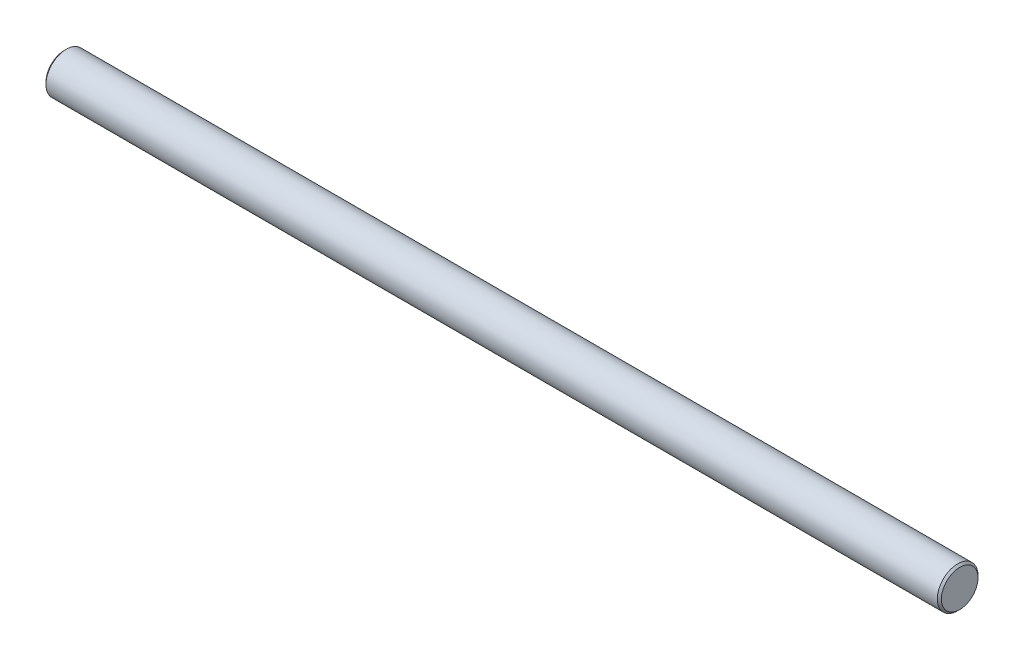
ISO-10303-21;
HEADER;
FILE_DESCRIPTION(('STEP AP214'),'2;1');
FILE_NAME('part.step','',(''),(''),'','','');
FILE_SCHEMA(('AUTOMOTIVE_DESIGN { 1 0 10303 214 1 1 1 1 }'));
ENDSEC;
DATA;
#1=APPLICATION_CONTEXT('core data for automotive mechanical design processes');
#2=APPLICATION_PROTOCOL_DEFINITION('international standard','automotive_design',2000,#1);
#3=PRODUCT_CONTEXT('',#1,'mechanical');
#4=PRODUCT('Part','Part','',(#3));
#5=PRODUCT_RELATED_PRODUCT_CATEGORY('part','',(#4));
#6=PRODUCT_DEFINITION_FORMATION('','',#4);
#7=PRODUCT_DEFINITION_CONTEXT('part definition',#1,'design');
#8=PRODUCT_DEFINITION('design','',#6,#7);
#9=PRODUCT_DEFINITION_SHAPE('','',#8);
#10=(LENGTH_UNIT() NAMED_UNIT(*) SI_UNIT(.MILLI.,.METRE.));
#11=(NAMED_UNIT(*) PLANE_ANGLE_UNIT() SI_UNIT($,.RADIAN.));
#12=(NAMED_UNIT(*) SI_UNIT($,.STERADIAN.) SOLID_ANGLE_UNIT());
#13=UNCERTAINTY_MEASURE_WITH_UNIT(LENGTH_MEASURE(1.E-05),#10,'distance_accuracy_value','');
#14=(GEOMETRIC_REPRESENTATION_CONTEXT(3) GLOBAL_UNCERTAINTY_ASSIGNED_CONTEXT((#13)) GLOBAL_UNIT_ASSIGNED_CONTEXT((#10,
#11,#12)) REPRESENTATION_CONTEXT('',''));
#15=CARTESIAN_POINT('',(0.,0.,0.));
#16=DIRECTION('',(0.,0.,1.));
#17=DIRECTION('',(1.,0.,0.));
#18=AXIS2_PLACEMENT_3D('',#15,#16,#17);
#19=CARTESIAN_POINT('',(110.,0.,0.));
#20=DIRECTION('',(1.,0.,0.));
#21=DIRECTION('',(0.,0.,-1.));
#22=AXIS2_PLACEMENT_3D('',#19,#20,#21);
#23=PLANE('',#22);
#24=CARTESIAN_POINT('',(110.00000000007,0.,0.));
#25=DIRECTION('',(-1.,0.,0.));
#26=DIRECTION('',(0.,0.,1.));
#27=AXIS2_PLACEMENT_3D('',#24,#25,#26);
#28=CIRCLE('',#27,4.49999999995043);
#29=CARTESIAN_POINT('',(110.00000000007,0.,4.49999999995043));
#30=VERTEX_POINT('',#29);
#31=EDGE_CURVE('E18',#30,#30,#28,.T.);
#32=ORIENTED_EDGE('',*,*,#31,.F.);
#33=EDGE_LOOP('',(#32));
#34=FACE_BOUND('',#33,.T.);
#35=ADVANCED_FACE('F15',(#34),#23,.T.);
#36=CARTESIAN_POINT('',(-110.,0.,0.));
#37=DIRECTION('',(1.,0.,0.));
#38=DIRECTION('',(0.,0.,-1.));
#39=AXIS2_PLACEMENT_3D('',#36,#37,#38);
#40=PLANE('',#39);
#41=CARTESIAN_POINT('',(-110.00000000007,0.,0.));
#42=DIRECTION('',(1.,0.,0.));
#43=DIRECTION('',(0.,0.,-1.));
#44=AXIS2_PLACEMENT_3D('',#41,#42,#43);
#45=CIRCLE('',#44,4.49999999995043);
#46=CARTESIAN_POINT('',(-110.00000000007,0.,-4.49999999995043));
#47=VERTEX_POINT('',#46);
#48=EDGE_CURVE('E27',#47,#47,#45,.T.);
#49=ORIENTED_EDGE('',*,*,#48,.F.);
#50=EDGE_LOOP('',(#49));
#51=FACE_BOUND('',#50,.T.);
#52=ADVANCED_FACE('F38',(#51),#40,.F.);
#53=CARTESIAN_POINT('',(109.500000000139,0.,0.));
#54=DIRECTION('',(-1.,0.,0.));
#55=DIRECTION('',(0.,0.,1.));
#56=AXIS2_PLACEMENT_3D('',#53,#54,#55);
#57=CONICAL_SURFACE('',#56,4.99999999988177,0.785398163397448);
#58=CARTESIAN_POINT('',(109.5,0.,0.));
#59=DIRECTION('',(1.,0.,0.));
#60=DIRECTION('',(0.,0.,-1.));
#61=AXIS2_PLACEMENT_3D('',#58,#59,#60);
#62=CIRCLE('',#61,4.99999999999999);
#63=CARTESIAN_POINT('',(109.5,0.,-4.99999999999999));
#64=VERTEX_POINT('',#63);
#65=EDGE_CURVE('E22',#64,#64,#62,.F.);
#66=ORIENTED_EDGE('',*,*,#65,.F.);
#67=EDGE_LOOP('',(#66));
#68=FACE_BOUND('',#67,.T.);
#69=ORIENTED_EDGE('',*,*,#31,.T.);
#70=EDGE_LOOP('',(#69));
#71=FACE_BOUND('',#70,.T.);
#72=ADVANCED_FACE('F35',(#68,#71),#57,.T.);
#73=CARTESIAN_POINT('',(-109.500000000139,0.,0.));
#74=DIRECTION('',(1.,0.,0.));
#75=DIRECTION('',(0.,0.,-1.));
#76=AXIS2_PLACEMENT_3D('',#73,#74,#75);
#77=CONICAL_SURFACE('',#76,4.99999999988177,0.785398163397448);
#78=CARTESIAN_POINT('',(-109.5,0.,0.));
#79=DIRECTION('',(1.,0.,0.));
#80=DIRECTION('',(0.,0.,-1.));
#81=AXIS2_PLACEMENT_3D('',#78,#79,#80);
#82=CIRCLE('',#81,4.99999999999999);
#83=CARTESIAN_POINT('',(-109.5,0.,-4.99999999999999));
#84=VERTEX_POINT('',#83);
#85=EDGE_CURVE('E10',#84,#84,#82,.T.);
#86=ORIENTED_EDGE('',*,*,#85,.F.);
#87=EDGE_LOOP('',(#86));
#88=FACE_BOUND('',#87,.T.);
#89=ORIENTED_EDGE('',*,*,#48,.T.);
#90=EDGE_LOOP('',(#89));
#91=FACE_BOUND('',#90,.T.);
#92=ADVANCED_FACE('F46',(#88,#91),#77,.T.);
#93=CARTESIAN_POINT('',(0.,0.,0.));
#94=DIRECTION('',(1.,0.,0.));
#95=DIRECTION('',(0.,0.,-1.));
#96=AXIS2_PLACEMENT_3D('',#93,#94,#95);
#97=CYLINDRICAL_SURFACE('',#96,4.99999999999999);
#98=ORIENTED_EDGE('',*,*,#85,.T.);
#99=EDGE_LOOP('',(#98));
#100=FACE_BOUND('',#99,.T.);
#101=ORIENTED_EDGE('',*,*,#65,.T.);
#102=EDGE_LOOP('',(#101));
#103=FACE_BOUND('',#102,.T.);
#104=ADVANCED_FACE('F44',(#100,#103),#97,.T.);
#105=CLOSED_SHELL('',(#35,#52,#72,#92,#104));
#106=MANIFOLD_SOLID_BREP('B1',#105);
#107=ADVANCED_BREP_SHAPE_REPRESENTATION('',(#18,#106),#14);
#108=SHAPE_DEFINITION_REPRESENTATION(#9,#107);
ENDSEC;
END-ISO-10303-21;
